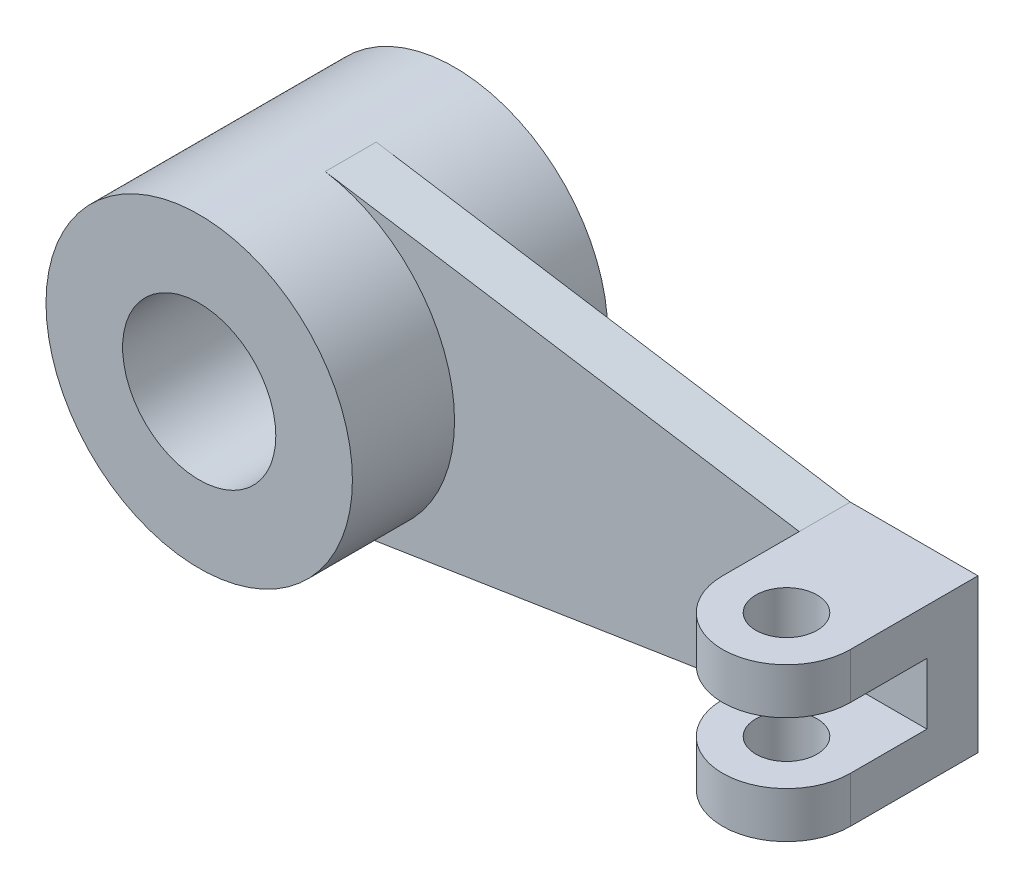
ISO-10303-21;
HEADER;
FILE_DESCRIPTION(('STEP AP214'),'2;1');
FILE_NAME('part.step','',(''),(''),'','','');
FILE_SCHEMA(('AUTOMOTIVE_DESIGN { 1 0 10303 214 1 1 1 1 }'));
ENDSEC;
DATA;
#1=APPLICATION_CONTEXT('core data for automotive mechanical design processes');
#2=APPLICATION_PROTOCOL_DEFINITION('international standard','automotive_design',2000,#1);
#3=PRODUCT_CONTEXT('',#1,'mechanical');
#4=PRODUCT('Part','Part','',(#3));
#5=PRODUCT_RELATED_PRODUCT_CATEGORY('part','',(#4));
#6=PRODUCT_DEFINITION_FORMATION('','',#4);
#7=PRODUCT_DEFINITION_CONTEXT('part definition',#1,'design');
#8=PRODUCT_DEFINITION('design','',#6,#7);
#9=PRODUCT_DEFINITION_SHAPE('','',#8);
#10=(LENGTH_UNIT() NAMED_UNIT(*) SI_UNIT(.MILLI.,.METRE.));
#11=(NAMED_UNIT(*) PLANE_ANGLE_UNIT() SI_UNIT($,.RADIAN.));
#12=(NAMED_UNIT(*) SI_UNIT($,.STERADIAN.) SOLID_ANGLE_UNIT());
#13=UNCERTAINTY_MEASURE_WITH_UNIT(LENGTH_MEASURE(1.E-05),#10,'distance_accuracy_value','');
#14=(GEOMETRIC_REPRESENTATION_CONTEXT(3) GLOBAL_UNCERTAINTY_ASSIGNED_CONTEXT((#13)) GLOBAL_UNIT_ASSIGNED_CONTEXT((#10,
#11,#12)) REPRESENTATION_CONTEXT('',''));
#15=CARTESIAN_POINT('',(0.,0.,0.));
#16=DIRECTION('',(0.,0.,1.));
#17=DIRECTION('',(1.,0.,0.));
#18=AXIS2_PLACEMENT_3D('',#15,#16,#17);
#19=CARTESIAN_POINT('',(0.,0.,50.));
#20=DIRECTION('',(0.,0.,1.));
#21=DIRECTION('',(1.,0.,0.));
#22=AXIS2_PLACEMENT_3D('',#19,#20,#21);
#23=PLANE('',#22);
#24=DIRECTION('',(1.,0.,0.));
#25=VECTOR('',#24,1.);
#26=CARTESIAN_POINT('',(975.,60.,50.));
#27=LINE('',#26,#25);
#28=CARTESIAN_POINT('',(975.,60.,50.));
#29=VERTEX_POINT('',#28);
#30=CARTESIAN_POINT('',(1225.,60.,50.));
#31=VERTEX_POINT('',#30);
#32=EDGE_CURVE('E63',#29,#31,#27,.T.);
#33=ORIENTED_EDGE('',*,*,#32,.F.);
#34=DIRECTION('',(0.,1.,0.));
#35=VECTOR('',#34,1.);
#36=CARTESIAN_POINT('',(975.,60.,50.));
#37=LINE('',#36,#35);
#38=CARTESIAN_POINT('',(975.,150.,50.));
#39=VERTEX_POINT('',#38);
#40=EDGE_CURVE('E145',#29,#39,#37,.T.);
#41=ORIENTED_EDGE('',*,*,#40,.T.);
#42=DIRECTION('',(-0.987800769478854,0.155722958541715,0.));
#43=VECTOR('',#42,1.);
#44=CARTESIAN_POINT('',(46.7168875625145,296.340230843656,50.));
#45=LINE('',#44,#43);
#46=CARTESIAN_POINT('',(46.7168875625145,296.340230843656,50.));
#47=VERTEX_POINT('',#46);
#48=EDGE_CURVE('E201',#39,#47,#45,.T.);
#49=ORIENTED_EDGE('',*,*,#48,.T.);
#50=CARTESIAN_POINT('',(0.,0.,50.));
#51=DIRECTION('',(0.,0.,-1.));
#52=DIRECTION('',(1.,0.,0.));
#53=AXIS2_PLACEMENT_3D('',#50,#51,#52);
#54=CIRCLE('',#53,300.);
#55=CARTESIAN_POINT('',(46.7168875625145,-296.340230843656,50.));
#56=VERTEX_POINT('',#55);
#57=EDGE_CURVE('E194',#47,#56,#54,.T.);
#58=ORIENTED_EDGE('',*,*,#57,.T.);
#59=DIRECTION('',(0.987800769478854,0.155722958541715,0.));
#60=VECTOR('',#59,1.);
#61=CARTESIAN_POINT('',(46.7168875625145,-296.340230843656,50.));
#62=LINE('',#61,#60);
#63=CARTESIAN_POINT('',(975.,-150.,50.));
#64=VERTEX_POINT('',#63);
#65=EDGE_CURVE('E197',#56,#64,#62,.T.);
#66=ORIENTED_EDGE('',*,*,#65,.T.);
#67=DIRECTION('',(0.,-1.,0.));
#68=VECTOR('',#67,1.);
#69=CARTESIAN_POINT('',(975.,-60.,50.));
#70=LINE('',#69,#68);
#71=CARTESIAN_POINT('',(975.,-60.,50.));
#72=VERTEX_POINT('',#71);
#73=EDGE_CURVE('E186',#72,#64,#70,.T.);
#74=ORIENTED_EDGE('',*,*,#73,.F.);
#75=DIRECTION('',(1.,0.,0.));
#76=VECTOR('',#75,1.);
#77=CARTESIAN_POINT('',(975.,-60.,50.));
#78=LINE('',#77,#76);
#79=CARTESIAN_POINT('',(1225.,-60.,50.));
#80=VERTEX_POINT('',#79);
#81=EDGE_CURVE('E169',#72,#80,#78,.T.);
#82=ORIENTED_EDGE('',*,*,#81,.T.);
#83=DIRECTION('',(0.,1.,0.));
#84=VECTOR('',#83,1.);
#85=CARTESIAN_POINT('',(1225.,150.,50.));
#86=LINE('',#85,#84);
#87=EDGE_CURVE('E68',#80,#31,#86,.T.);
#88=ORIENTED_EDGE('',*,*,#87,.T.);
#89=EDGE_LOOP('',(#33,#41,#49,#58,#66,#74,#82,#88));
#90=FACE_BOUND('',#89,.T.);
#91=ADVANCED_FACE('F48',(#90),#23,.T.);
#92=CARTESIAN_POINT('',(0.,0.,250.));
#93=DIRECTION('',(0.,0.,1.));
#94=DIRECTION('',(1.,0.,0.));
#95=AXIS2_PLACEMENT_3D('',#92,#93,#94);
#96=PLANE('',#95);
#97=CARTESIAN_POINT('',(0.,0.,250.));
#98=DIRECTION('',(0.,0.,1.));
#99=DIRECTION('',(1.,0.,0.));
#100=AXIS2_PLACEMENT_3D('',#97,#98,#99);
#101=CIRCLE('',#100,300.);
#102=CARTESIAN_POINT('',(300.,0.,250.));
#103=VERTEX_POINT('',#102);
#104=EDGE_CURVE('E12',#103,#103,#101,.T.);
#105=ORIENTED_EDGE('',*,*,#104,.T.);
#106=EDGE_LOOP('',(#105));
#107=FACE_BOUND('',#106,.T.);
#108=CARTESIAN_POINT('',(0.,0.,250.));
#109=DIRECTION('',(0.,0.,1.));
#110=DIRECTION('',(1.,0.,0.));
#111=AXIS2_PLACEMENT_3D('',#108,#109,#110);
#112=CIRCLE('',#111,150.);
#113=CARTESIAN_POINT('',(150.,0.,250.));
#114=VERTEX_POINT('',#113);
#115=EDGE_CURVE('E231',#114,#114,#112,.T.);
#116=ORIENTED_EDGE('',*,*,#115,.F.);
#117=EDGE_LOOP('',(#116));
#118=FACE_BOUND('',#117,.T.);
#119=ADVANCED_FACE('F254',(#107,#118),#96,.T.);
#120=CARTESIAN_POINT('',(0.,0.,-250.));
#121=DIRECTION('',(0.,0.,1.));
#122=DIRECTION('',(1.,0.,0.));
#123=AXIS2_PLACEMENT_3D('',#120,#121,#122);
#124=PLANE('',#123);
#125=CARTESIAN_POINT('',(0.,0.,-250.));
#126=DIRECTION('',(0.,0.,1.));
#127=DIRECTION('',(1.,0.,0.));
#128=AXIS2_PLACEMENT_3D('',#125,#126,#127);
#129=CIRCLE('',#128,300.);
#130=CARTESIAN_POINT('',(300.,0.,-250.));
#131=VERTEX_POINT('',#130);
#132=EDGE_CURVE('E52',#131,#131,#129,.T.);
#133=ORIENTED_EDGE('',*,*,#132,.F.);
#134=EDGE_LOOP('',(#133));
#135=FACE_BOUND('',#134,.T.);
#136=CARTESIAN_POINT('',(0.,0.,-250.));
#137=DIRECTION('',(0.,0.,1.));
#138=DIRECTION('',(1.,0.,0.));
#139=AXIS2_PLACEMENT_3D('',#136,#137,#138);
#140=CIRCLE('',#139,150.);
#141=CARTESIAN_POINT('',(150.,0.,-250.));
#142=VERTEX_POINT('',#141);
#143=EDGE_CURVE('E230',#142,#142,#140,.T.);
#144=ORIENTED_EDGE('',*,*,#143,.T.);
#145=EDGE_LOOP('',(#144));
#146=FACE_BOUND('',#145,.T.);
#147=ADVANCED_FACE('F237',(#135,#146),#124,.F.);
#148=CARTESIAN_POINT('',(0.,0.,250.));
#149=DIRECTION('',(0.,0.,-1.));
#150=DIRECTION('',(-1.,0.,0.));
#151=AXIS2_PLACEMENT_3D('',#148,#149,#150);
#152=CYLINDRICAL_SURFACE('',#151,300.);
#153=DIRECTION('',(0.,0.,-1.));
#154=VECTOR('',#153,1.);
#155=CARTESIAN_POINT('',(46.7168875625145,-296.340230843656,50.));
#156=LINE('',#155,#154);
#157=CARTESIAN_POINT('',(46.7168875625145,-296.340230843656,-50.));
#158=VERTEX_POINT('',#157);
#159=EDGE_CURVE('E227',#56,#158,#156,.T.);
#160=ORIENTED_EDGE('',*,*,#159,.F.);
#161=ORIENTED_EDGE('',*,*,#57,.F.);
#162=DIRECTION('',(0.,0.,-1.));
#163=VECTOR('',#162,1.);
#164=CARTESIAN_POINT('',(46.7168875625145,296.340230843656,50.));
#165=LINE('',#164,#163);
#166=CARTESIAN_POINT('',(46.7168875625145,296.340230843656,-50.));
#167=VERTEX_POINT('',#166);
#168=EDGE_CURVE('E204',#47,#167,#165,.T.);
#169=ORIENTED_EDGE('',*,*,#168,.T.);
#170=CARTESIAN_POINT('',(0.,0.,-50.));
#171=DIRECTION('',(0.,0.,-1.));
#172=DIRECTION('',(1.,0.,0.));
#173=AXIS2_PLACEMENT_3D('',#170,#171,#172);
#174=CIRCLE('',#173,300.);
#175=EDGE_CURVE('E189',#167,#158,#174,.T.);
#176=ORIENTED_EDGE('',*,*,#175,.T.);
#177=EDGE_LOOP('',(#160,#161,#169,#176));
#178=FACE_BOUND('',#177,.T.);
#179=ORIENTED_EDGE('',*,*,#104,.F.);
#180=EDGE_LOOP('',(#179));
#181=FACE_BOUND('',#180,.T.);
#182=ORIENTED_EDGE('',*,*,#132,.T.);
#183=EDGE_LOOP('',(#182));
#184=FACE_BOUND('',#183,.T.);
#185=ADVANCED_FACE('F50',(#178,#181,#184),#152,.T.);
#186=CARTESIAN_POINT('',(0.,0.,250.));
#187=DIRECTION('',(0.,0.,-1.));
#188=DIRECTION('',(-1.,0.,0.));
#189=AXIS2_PLACEMENT_3D('',#186,#187,#188);
#190=CYLINDRICAL_SURFACE('',#189,150.);
#191=ORIENTED_EDGE('',*,*,#115,.T.);
#192=EDGE_LOOP('',(#191));
#193=FACE_BOUND('',#192,.T.);
#194=ORIENTED_EDGE('',*,*,#143,.F.);
#195=EDGE_LOOP('',(#194));
#196=FACE_BOUND('',#195,.T.);
#197=ADVANCED_FACE('F239',(#193,#196),#190,.F.);
#198=CARTESIAN_POINT('',(46.7168875625145,-296.340230843656,50.));
#199=DIRECTION('',(-0.155722958541715,0.987800769478854,0.));
#200=DIRECTION('',(-0.987800769478854,-0.155722958541715,0.));
#201=AXIS2_PLACEMENT_3D('',#198,#199,#200);
#202=PLANE('',#201);
#203=DIRECTION('',(0.987800769478854,0.155722958541715,0.));
#204=VECTOR('',#203,1.);
#205=CARTESIAN_POINT('',(46.7168875625145,-296.340230843656,-50.));
#206=LINE('',#205,#204);
#207=CARTESIAN_POINT('',(975.,-150.,-50.));
#208=VERTEX_POINT('',#207);
#209=EDGE_CURVE('E206',#158,#208,#206,.T.);
#210=ORIENTED_EDGE('',*,*,#209,.T.);
#211=DIRECTION('',(0.,0.,-1.));
#212=VECTOR('',#211,1.);
#213=CARTESIAN_POINT('',(975.,-150.,50.));
#214=LINE('',#213,#212);
#215=EDGE_CURVE('E224',#64,#208,#214,.T.);
#216=ORIENTED_EDGE('',*,*,#215,.F.);
#217=ORIENTED_EDGE('',*,*,#65,.F.);
#218=ORIENTED_EDGE('',*,*,#159,.T.);
#219=EDGE_LOOP('',(#210,#216,#217,#218));
#220=FACE_BOUND('',#219,.T.);
#221=ADVANCED_FACE('F241',(#220),#202,.F.);
#222=CARTESIAN_POINT('',(975.,-150.,50.));
#223=DIRECTION('',(0.,1.,0.));
#224=DIRECTION('',(0.,0.,1.));
#225=AXIS2_PLACEMENT_3D('',#222,#223,#224);
#226=PLANE('',#225);
#227=DIRECTION('',(1.,0.,0.));
#228=VECTOR('',#227,1.);
#229=CARTESIAN_POINT('',(975.,-150.,-50.));
#230=LINE('',#229,#228);
#231=CARTESIAN_POINT('',(1225.,-150.,-50.));
#232=VERTEX_POINT('',#231);
#233=EDGE_CURVE('E208',#208,#232,#230,.T.);
#234=ORIENTED_EDGE('',*,*,#233,.T.);
#235=DIRECTION('',(0.,0.,-1.));
#236=VECTOR('',#235,1.);
#237=CARTESIAN_POINT('',(1225.,-150.,50.));
#238=LINE('',#237,#236);
#239=CARTESIAN_POINT('',(1225.,-150.,200.));
#240=VERTEX_POINT('',#239);
#241=EDGE_CURVE('E221',#240,#232,#238,.T.);
#242=ORIENTED_EDGE('',*,*,#241,.F.);
#243=CARTESIAN_POINT('',(1100.,-150.,200.));
#244=DIRECTION('',(0.,-1.,0.));
#245=DIRECTION('',(0.,0.,-1.));
#246=AXIS2_PLACEMENT_3D('',#243,#244,#245);
#247=CIRCLE('',#246,125.);
#248=CARTESIAN_POINT('',(975.,-150.,200.));
#249=VERTEX_POINT('',#248);
#250=EDGE_CURVE('E166',#240,#249,#247,.T.);
#251=ORIENTED_EDGE('',*,*,#250,.T.);
#252=DIRECTION('',(0.,0.,-1.));
#253=VECTOR('',#252,1.);
#254=CARTESIAN_POINT('',(975.,-150.,50.));
#255=LINE('',#254,#253);
#256=EDGE_CURVE('E172',#249,#64,#255,.T.);
#257=ORIENTED_EDGE('',*,*,#256,.T.);
#258=ORIENTED_EDGE('',*,*,#215,.T.);
#259=EDGE_LOOP('',(#234,#242,#251,#257,#258));
#260=FACE_BOUND('',#259,.T.);
#261=CARTESIAN_POINT('',(1100.,-150.,200.));
#262=DIRECTION('',(0.,-1.,0.));
#263=DIRECTION('',(0.,0.,-1.));
#264=AXIS2_PLACEMENT_3D('',#261,#262,#263);
#265=CIRCLE('',#264,60.0000000000001);
#266=CARTESIAN_POINT('',(1100.,-150.,140.));
#267=VERTEX_POINT('',#266);
#268=EDGE_CURVE('E162',#267,#267,#265,.T.);
#269=ORIENTED_EDGE('',*,*,#268,.F.);
#270=EDGE_LOOP('',(#269));
#271=FACE_BOUND('',#270,.T.);
#272=ADVANCED_FACE('F248',(#260,#271),#226,.F.);
#273=CARTESIAN_POINT('',(1225.,150.,50.));
#274=DIRECTION('',(-1.,0.,0.));
#275=DIRECTION('',(0.,0.,1.));
#276=AXIS2_PLACEMENT_3D('',#273,#274,#275);
#277=PLANE('',#276);
#278=DIRECTION('',(0.,1.,0.));
#279=VECTOR('',#278,1.);
#280=CARTESIAN_POINT('',(1225.,150.,-50.));
#281=LINE('',#280,#279);
#282=CARTESIAN_POINT('',(1225.,150.,-50.));
#283=VERTEX_POINT('',#282);
#284=EDGE_CURVE('E210',#232,#283,#281,.T.);
#285=ORIENTED_EDGE('',*,*,#284,.T.);
#286=DIRECTION('',(0.,0.,-1.));
#287=VECTOR('',#286,1.);
#288=CARTESIAN_POINT('',(1225.,150.,50.));
#289=LINE('',#288,#287);
#290=CARTESIAN_POINT('',(1225.,150.,200.));
#291=VERTEX_POINT('',#290);
#292=EDGE_CURVE('E141',#291,#283,#289,.T.);
#293=ORIENTED_EDGE('',*,*,#292,.F.);
#294=DIRECTION('',(0.,1.,0.));
#295=VECTOR('',#294,1.);
#296=CARTESIAN_POINT('',(1225.,60.,200.));
#297=LINE('',#296,#295);
#298=CARTESIAN_POINT('',(1225.,60.,200.));
#299=VERTEX_POINT('',#298);
#300=EDGE_CURVE('E138',#299,#291,#297,.T.);
#301=ORIENTED_EDGE('',*,*,#300,.F.);
#302=DIRECTION('',(0.,0.,1.));
#303=VECTOR('',#302,1.);
#304=CARTESIAN_POINT('',(1225.,60.,50.));
#305=LINE('',#304,#303);
#306=EDGE_CURVE('E130',#31,#299,#305,.T.);
#307=ORIENTED_EDGE('',*,*,#306,.F.);
#308=ORIENTED_EDGE('',*,*,#87,.F.);
#309=DIRECTION('',(0.,0.,1.));
#310=VECTOR('',#309,1.);
#311=CARTESIAN_POINT('',(1225.,-60.,200.));
#312=LINE('',#311,#310);
#313=CARTESIAN_POINT('',(1225.,-60.,200.));
#314=VERTEX_POINT('',#313);
#315=EDGE_CURVE('E171',#80,#314,#312,.T.);
#316=ORIENTED_EDGE('',*,*,#315,.T.);
#317=DIRECTION('',(0.,-1.,0.));
#318=VECTOR('',#317,1.);
#319=CARTESIAN_POINT('',(1225.,-60.,200.));
#320=LINE('',#319,#318);
#321=EDGE_CURVE('E181',#314,#240,#320,.T.);
#322=ORIENTED_EDGE('',*,*,#321,.T.);
#323=ORIENTED_EDGE('',*,*,#241,.T.);
#324=EDGE_LOOP('',(#285,#293,#301,#307,#308,#316,#322,#323));
#325=FACE_BOUND('',#324,.T.);
#326=ADVANCED_FACE('F139',(#325),#277,.F.);
#327=CARTESIAN_POINT('',(975.,150.,50.));
#328=DIRECTION('',(0.,-1.,0.));
#329=DIRECTION('',(0.,0.,-1.));
#330=AXIS2_PLACEMENT_3D('',#327,#328,#329);
#331=PLANE('',#330);
#332=DIRECTION('',(-1.,0.,0.));
#333=VECTOR('',#332,1.);
#334=CARTESIAN_POINT('',(975.,150.,-50.));
#335=LINE('',#334,#333);
#336=CARTESIAN_POINT('',(975.,150.,-50.));
#337=VERTEX_POINT('',#336);
#338=EDGE_CURVE('E212',#283,#337,#335,.T.);
#339=ORIENTED_EDGE('',*,*,#338,.T.);
#340=DIRECTION('',(0.,0.,-1.));
#341=VECTOR('',#340,1.);
#342=CARTESIAN_POINT('',(975.,150.,50.));
#343=LINE('',#342,#341);
#344=EDGE_CURVE('E217',#39,#337,#343,.T.);
#345=ORIENTED_EDGE('',*,*,#344,.F.);
#346=DIRECTION('',(0.,0.,-1.));
#347=VECTOR('',#346,1.);
#348=CARTESIAN_POINT('',(975.,150.,200.));
#349=LINE('',#348,#347);
#350=CARTESIAN_POINT('',(975.,150.,200.));
#351=VERTEX_POINT('',#350);
#352=EDGE_CURVE('E154',#351,#39,#349,.T.);
#353=ORIENTED_EDGE('',*,*,#352,.F.);
#354=CARTESIAN_POINT('',(1100.,150.,200.));
#355=DIRECTION('',(0.,1.,0.));
#356=DIRECTION('',(0.,0.,1.));
#357=AXIS2_PLACEMENT_3D('',#354,#355,#356);
#358=CIRCLE('',#357,125.);
#359=EDGE_CURVE('E157',#351,#291,#358,.T.);
#360=ORIENTED_EDGE('',*,*,#359,.T.);
#361=ORIENTED_EDGE('',*,*,#292,.T.);
#362=EDGE_LOOP('',(#339,#345,#353,#360,#361));
#363=FACE_BOUND('',#362,.T.);
#364=CARTESIAN_POINT('',(1100.,150.,200.));
#365=DIRECTION('',(0.,1.,0.));
#366=DIRECTION('',(0.,0.,1.));
#367=AXIS2_PLACEMENT_3D('',#364,#365,#366);
#368=CIRCLE('',#367,60.0000000000001);
#369=CARTESIAN_POINT('',(1100.,150.,260.));
#370=VERTEX_POINT('',#369);
#371=EDGE_CURVE('E329',#370,#370,#368,.T.);
#372=ORIENTED_EDGE('',*,*,#371,.F.);
#373=EDGE_LOOP('',(#372));
#374=FACE_BOUND('',#373,.T.);
#375=ADVANCED_FACE('F272',(#363,#374),#331,.F.);
#376=CARTESIAN_POINT('',(46.7168875625145,296.340230843656,50.));
#377=DIRECTION('',(-0.155722958541715,-0.987800769478854,0.));
#378=DIRECTION('',(0.987800769478854,-0.155722958541715,0.));
#379=AXIS2_PLACEMENT_3D('',#376,#377,#378);
#380=PLANE('',#379);
#381=DIRECTION('',(-0.987800769478854,0.155722958541715,0.));
#382=VECTOR('',#381,1.);
#383=CARTESIAN_POINT('',(46.7168875625145,296.340230843656,-50.));
#384=LINE('',#383,#382);
#385=EDGE_CURVE('E198',#337,#167,#384,.T.);
#386=ORIENTED_EDGE('',*,*,#385,.T.);
#387=ORIENTED_EDGE('',*,*,#168,.F.);
#388=ORIENTED_EDGE('',*,*,#48,.F.);
#389=ORIENTED_EDGE('',*,*,#344,.T.);
#390=EDGE_LOOP('',(#386,#387,#388,#389));
#391=FACE_BOUND('',#390,.T.);
#392=ADVANCED_FACE('F268',(#391),#380,.F.);
#393=CARTESIAN_POINT('',(0.,0.,-50.));
#394=DIRECTION('',(0.,0.,1.));
#395=DIRECTION('',(1.,0.,0.));
#396=AXIS2_PLACEMENT_3D('',#393,#394,#395);
#397=PLANE('',#396);
#398=ORIENTED_EDGE('',*,*,#175,.F.);
#399=ORIENTED_EDGE('',*,*,#385,.F.);
#400=ORIENTED_EDGE('',*,*,#338,.F.);
#401=ORIENTED_EDGE('',*,*,#284,.F.);
#402=ORIENTED_EDGE('',*,*,#233,.F.);
#403=ORIENTED_EDGE('',*,*,#209,.F.);
#404=EDGE_LOOP('',(#398,#399,#400,#401,#402,#403));
#405=FACE_BOUND('',#404,.T.);
#406=ADVANCED_FACE('F264',(#405),#397,.F.);
#407=CARTESIAN_POINT('',(975.,-60.,50.));
#408=DIRECTION('',(-1.,0.,0.));
#409=DIRECTION('',(0.,0.,1.));
#410=AXIS2_PLACEMENT_3D('',#407,#408,#409);
#411=PLANE('',#410);
#412=ORIENTED_EDGE('',*,*,#256,.F.);
#413=DIRECTION('',(0.,-1.,0.));
#414=VECTOR('',#413,1.);
#415=CARTESIAN_POINT('',(975.,-60.,200.));
#416=LINE('',#415,#414);
#417=CARTESIAN_POINT('',(975.,-60.,200.));
#418=VERTEX_POINT('',#417);
#419=EDGE_CURVE('E190',#418,#249,#416,.T.);
#420=ORIENTED_EDGE('',*,*,#419,.F.);
#421=DIRECTION('',(0.,0.,-1.));
#422=VECTOR('',#421,1.);
#423=CARTESIAN_POINT('',(975.,-60.,50.));
#424=LINE('',#423,#422);
#425=EDGE_CURVE('E178',#418,#72,#424,.T.);
#426=ORIENTED_EDGE('',*,*,#425,.T.);
#427=ORIENTED_EDGE('',*,*,#73,.T.);
#428=EDGE_LOOP('',(#412,#420,#426,#427));
#429=FACE_BOUND('',#428,.T.);
#430=ADVANCED_FACE('F267',(#429),#411,.T.);
#431=CARTESIAN_POINT('',(1100.,-60.,200.));
#432=DIRECTION('',(0.,-1.,0.));
#433=DIRECTION('',(0.,0.,-1.));
#434=AXIS2_PLACEMENT_3D('',#431,#432,#433);
#435=CYLINDRICAL_SURFACE('',#434,125.);
#436=ORIENTED_EDGE('',*,*,#250,.F.);
#437=ORIENTED_EDGE('',*,*,#321,.F.);
#438=CARTESIAN_POINT('',(1100.,-60.,200.));
#439=DIRECTION('',(0.,-1.,0.));
#440=DIRECTION('',(0.,0.,-1.));
#441=AXIS2_PLACEMENT_3D('',#438,#439,#440);
#442=CIRCLE('',#441,125.);
#443=EDGE_CURVE('E175',#314,#418,#442,.T.);
#444=ORIENTED_EDGE('',*,*,#443,.T.);
#445=ORIENTED_EDGE('',*,*,#419,.T.);
#446=EDGE_LOOP('',(#436,#437,#444,#445));
#447=FACE_BOUND('',#446,.T.);
#448=ADVANCED_FACE('F262',(#447),#435,.T.);
#449=CARTESIAN_POINT('',(1100.,-60.,200.));
#450=DIRECTION('',(0.,-1.,0.));
#451=DIRECTION('',(0.,0.,-1.));
#452=AXIS2_PLACEMENT_3D('',#449,#450,#451);
#453=PLANE('',#452);
#454=CARTESIAN_POINT('',(1100.,-60.,200.));
#455=DIRECTION('',(0.,-1.,0.));
#456=DIRECTION('',(0.,0.,-1.));
#457=AXIS2_PLACEMENT_3D('',#454,#455,#456);
#458=CIRCLE('',#457,60.0000000000001);
#459=CARTESIAN_POINT('',(1100.,-60.,140.));
#460=VERTEX_POINT('',#459);
#461=EDGE_CURVE('E163',#460,#460,#458,.T.);
#462=ORIENTED_EDGE('',*,*,#461,.T.);
#463=EDGE_LOOP('',(#462));
#464=FACE_BOUND('',#463,.T.);
#465=ORIENTED_EDGE('',*,*,#81,.F.);
#466=ORIENTED_EDGE('',*,*,#425,.F.);
#467=ORIENTED_EDGE('',*,*,#443,.F.);
#468=ORIENTED_EDGE('',*,*,#315,.F.);
#469=EDGE_LOOP('',(#465,#466,#467,#468));
#470=FACE_BOUND('',#469,.T.);
#471=ADVANCED_FACE('F290',(#464,#470),#453,.F.);
#472=CARTESIAN_POINT('',(1100.,-60.,200.));
#473=DIRECTION('',(0.,-1.,0.));
#474=DIRECTION('',(0.,0.,-1.));
#475=AXIS2_PLACEMENT_3D('',#472,#473,#474);
#476=CYLINDRICAL_SURFACE('',#475,60.0000000000001);
#477=ORIENTED_EDGE('',*,*,#461,.F.);
#478=EDGE_LOOP('',(#477));
#479=FACE_BOUND('',#478,.T.);
#480=ORIENTED_EDGE('',*,*,#268,.T.);
#481=EDGE_LOOP('',(#480));
#482=FACE_BOUND('',#481,.T.);
#483=ADVANCED_FACE('F287',(#479,#482),#476,.F.);
#484=CARTESIAN_POINT('',(975.,60.,200.));
#485=DIRECTION('',(1.,0.,0.));
#486=DIRECTION('',(0.,0.,-1.));
#487=AXIS2_PLACEMENT_3D('',#484,#485,#486);
#488=PLANE('',#487);
#489=ORIENTED_EDGE('',*,*,#352,.T.);
#490=ORIENTED_EDGE('',*,*,#40,.F.);
#491=DIRECTION('',(0.,0.,-1.));
#492=VECTOR('',#491,1.);
#493=CARTESIAN_POINT('',(975.,60.,200.));
#494=LINE('',#493,#492);
#495=CARTESIAN_POINT('',(975.,60.,200.));
#496=VERTEX_POINT('',#495);
#497=EDGE_CURVE('E159',#496,#29,#494,.T.);
#498=ORIENTED_EDGE('',*,*,#497,.F.);
#499=DIRECTION('',(0.,1.,0.));
#500=VECTOR('',#499,1.);
#501=CARTESIAN_POINT('',(975.,60.,200.));
#502=LINE('',#501,#500);
#503=EDGE_CURVE('E146',#496,#351,#502,.T.);
#504=ORIENTED_EDGE('',*,*,#503,.T.);
#505=EDGE_LOOP('',(#489,#490,#498,#504));
#506=FACE_BOUND('',#505,.T.);
#507=ADVANCED_FACE('F289',(#506),#488,.F.);
#508=CARTESIAN_POINT('',(1100.,60.,200.));
#509=DIRECTION('',(0.,1.,0.));
#510=DIRECTION('',(0.,0.,1.));
#511=AXIS2_PLACEMENT_3D('',#508,#509,#510);
#512=CYLINDRICAL_SURFACE('',#511,125.);
#513=ORIENTED_EDGE('',*,*,#359,.F.);
#514=ORIENTED_EDGE('',*,*,#503,.F.);
#515=CARTESIAN_POINT('',(1100.,60.,200.));
#516=DIRECTION('',(0.,1.,0.));
#517=DIRECTION('',(0.,0.,1.));
#518=AXIS2_PLACEMENT_3D('',#515,#516,#517);
#519=CIRCLE('',#518,125.);
#520=EDGE_CURVE('E134',#496,#299,#519,.T.);
#521=ORIENTED_EDGE('',*,*,#520,.T.);
#522=ORIENTED_EDGE('',*,*,#300,.T.);
#523=EDGE_LOOP('',(#513,#514,#521,#522));
#524=FACE_BOUND('',#523,.T.);
#525=ADVANCED_FACE('F148',(#524),#512,.T.);
#526=CARTESIAN_POINT('',(1100.,60.,200.));
#527=DIRECTION('',(0.,1.,0.));
#528=DIRECTION('',(0.,0.,1.));
#529=AXIS2_PLACEMENT_3D('',#526,#527,#528);
#530=PLANE('',#529);
#531=CARTESIAN_POINT('',(1100.,60.,200.));
#532=DIRECTION('',(0.,1.,0.));
#533=DIRECTION('',(0.,0.,1.));
#534=AXIS2_PLACEMENT_3D('',#531,#532,#533);
#535=CIRCLE('',#534,60.0000000000001);
#536=CARTESIAN_POINT('',(1100.,60.,260.));
#537=VERTEX_POINT('',#536);
#538=EDGE_CURVE('E158',#537,#537,#535,.T.);
#539=ORIENTED_EDGE('',*,*,#538,.T.);
#540=EDGE_LOOP('',(#539));
#541=FACE_BOUND('',#540,.T.);
#542=ORIENTED_EDGE('',*,*,#497,.T.);
#543=ORIENTED_EDGE('',*,*,#32,.T.);
#544=ORIENTED_EDGE('',*,*,#306,.T.);
#545=ORIENTED_EDGE('',*,*,#520,.F.);
#546=EDGE_LOOP('',(#542,#543,#544,#545));
#547=FACE_BOUND('',#546,.T.);
#548=ADVANCED_FACE('F132',(#541,#547),#530,.F.);
#549=CARTESIAN_POINT('',(1100.,60.,200.));
#550=DIRECTION('',(0.,1.,0.));
#551=DIRECTION('',(0.,0.,1.));
#552=AXIS2_PLACEMENT_3D('',#549,#550,#551);
#553=CYLINDRICAL_SURFACE('',#552,60.0000000000001);
#554=ORIENTED_EDGE('',*,*,#538,.F.);
#555=EDGE_LOOP('',(#554));
#556=FACE_BOUND('',#555,.T.);
#557=ORIENTED_EDGE('',*,*,#371,.T.);
#558=EDGE_LOOP('',(#557));
#559=FACE_BOUND('',#558,.T.);
#560=ADVANCED_FACE('F336',(#556,#559),#553,.F.);
#561=CLOSED_SHELL('',(#91,#119,#147,#185,#197,#221,#272,#326,#375,#392,#406,#430,#448,#471,#483,
#507,#525,#548,#560));
#562=MANIFOLD_SOLID_BREP('B2',#561);
#563=ADVANCED_BREP_SHAPE_REPRESENTATION('',(#18,#562),#14);
#564=SHAPE_DEFINITION_REPRESENTATION(#9,#563);
ENDSEC;
END-ISO-10303-21;
